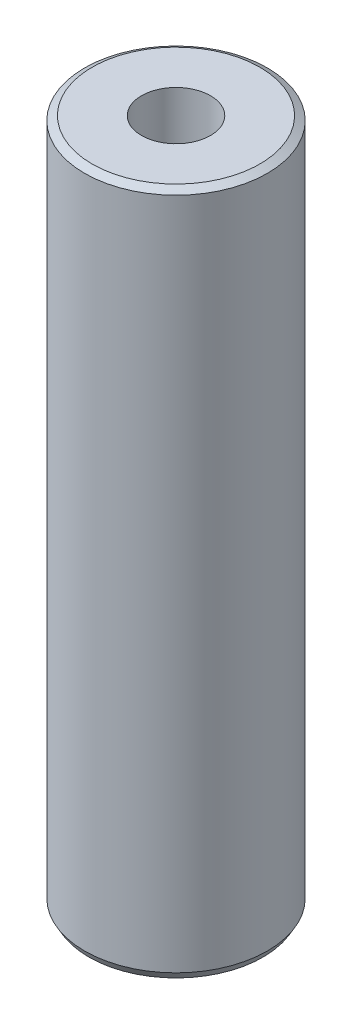
ISO-10303-21;
HEADER;
FILE_DESCRIPTION(('STEP AP214'),'2;1');
FILE_NAME('part.step','',(''),(''),'','','');
FILE_SCHEMA(('AUTOMOTIVE_DESIGN { 1 0 10303 214 1 1 1 1 }'));
ENDSEC;
DATA;
#1=APPLICATION_CONTEXT('core data for automotive mechanical design processes');
#2=APPLICATION_PROTOCOL_DEFINITION('international standard','automotive_design',2000,#1);
#3=PRODUCT_CONTEXT('',#1,'mechanical');
#4=PRODUCT('Part','Part','',(#3));
#5=PRODUCT_RELATED_PRODUCT_CATEGORY('part','',(#4));
#6=PRODUCT_DEFINITION_FORMATION('','',#4);
#7=PRODUCT_DEFINITION_CONTEXT('part definition',#1,'design');
#8=PRODUCT_DEFINITION('design','',#6,#7);
#9=PRODUCT_DEFINITION_SHAPE('','',#8);
#10=(LENGTH_UNIT() NAMED_UNIT(*) SI_UNIT(.MILLI.,.METRE.));
#11=(NAMED_UNIT(*) PLANE_ANGLE_UNIT() SI_UNIT($,.RADIAN.));
#12=(NAMED_UNIT(*) SI_UNIT($,.STERADIAN.) SOLID_ANGLE_UNIT());
#13=UNCERTAINTY_MEASURE_WITH_UNIT(LENGTH_MEASURE(1.E-05),#10,'distance_accuracy_value','');
#14=(GEOMETRIC_REPRESENTATION_CONTEXT(3) GLOBAL_UNCERTAINTY_ASSIGNED_CONTEXT((#13)) GLOBAL_UNIT_ASSIGNED_CONTEXT((#10,
#11,#12)) REPRESENTATION_CONTEXT('',''));
#15=CARTESIAN_POINT('',(0.,0.,0.));
#16=DIRECTION('',(0.,0.,1.));
#17=DIRECTION('',(1.,0.,0.));
#18=AXIS2_PLACEMENT_3D('',#15,#16,#17);
#19=CARTESIAN_POINT('',(0.,449.970885556218,0.));
#20=DIRECTION('',(0.,-1.,0.));
#21=DIRECTION('',(0.,0.,-1.));
#22=AXIS2_PLACEMENT_3D('',#19,#20,#21);
#23=CYLINDRICAL_SURFACE('',#22,60.);
#24=CARTESIAN_POINT('',(0.,447.126029534184,0.));
#25=DIRECTION('',(0.,1.,0.));
#26=DIRECTION('',(0.,0.,1.));
#27=AXIS2_PLACEMENT_3D('',#24,#25,#26);
#28=CIRCLE('',#27,60.);
#29=CARTESIAN_POINT('',(0.,447.126029534184,-60.));
#30=VERTEX_POINT('',#29);
#31=EDGE_CURVE('E50',#30,#30,#28,.F.);
#32=ORIENTED_EDGE('',*,*,#31,.T.);
#33=EDGE_LOOP('',(#32));
#34=FACE_BOUND('',#33,.T.);
#35=CARTESIAN_POINT('',(0.,4.92743517038169,0.));
#36=DIRECTION('',(0.,1.,0.));
#37=DIRECTION('',(0.,0.,1.));
#38=AXIS2_PLACEMENT_3D('',#35,#36,#37);
#39=CIRCLE('',#38,60.);
#40=CARTESIAN_POINT('',(0.,4.92743517038169,60.));
#41=VERTEX_POINT('',#40);
#42=EDGE_CURVE('E51',#41,#41,#39,.T.);
#43=ORIENTED_EDGE('',*,*,#42,.T.);
#44=EDGE_LOOP('',(#43));
#45=FACE_BOUND('',#44,.T.);
#46=ADVANCED_FACE('F39',(#34,#45),#23,.T.);
#47=CARTESIAN_POINT('',(0.,449.970885556218,0.));
#48=DIRECTION('',(0.,1.,0.));
#49=DIRECTION('',(0.,0.,1.));
#50=AXIS2_PLACEMENT_3D('',#47,#48,#49);
#51=PLANE('',#50);
#52=CARTESIAN_POINT('',(0.,449.970885556218,0.));
#53=DIRECTION('',(0.,1.,0.));
#54=DIRECTION('',(0.,0.,1.));
#55=AXIS2_PLACEMENT_3D('',#52,#53,#54);
#56=CIRCLE('',#55,55.0725648296183);
#57=CARTESIAN_POINT('',(0.,449.970885556218,-55.0725648296184));
#58=VERTEX_POINT('',#57);
#59=EDGE_CURVE('E54',#58,#58,#56,.T.);
#60=ORIENTED_EDGE('',*,*,#59,.T.);
#61=EDGE_LOOP('',(#60));
#62=FACE_BOUND('',#61,.T.);
#63=CARTESIAN_POINT('',(0.,449.970885556218,0.));
#64=DIRECTION('',(0.,1.,0.));
#65=DIRECTION('',(0.,0.,1.));
#66=AXIS2_PLACEMENT_3D('',#63,#64,#65);
#67=CIRCLE('',#66,22.6558316969732);
#68=CARTESIAN_POINT('',(0.,449.970885556218,22.6558316969732));
#69=VERTEX_POINT('',#68);
#70=EDGE_CURVE('E58',#69,#69,#67,.T.);
#71=ORIENTED_EDGE('',*,*,#70,.F.);
#72=EDGE_LOOP('',(#71));
#73=FACE_BOUND('',#72,.T.);
#74=ADVANCED_FACE('F69',(#62,#73),#51,.T.);
#75=CARTESIAN_POINT('',(0.,0.,0.));
#76=DIRECTION('',(0.,1.,0.));
#77=DIRECTION('',(0.,0.,1.));
#78=AXIS2_PLACEMENT_3D('',#75,#76,#77);
#79=PLANE('',#78);
#80=CARTESIAN_POINT('',(0.,0.,0.));
#81=DIRECTION('',(0.,1.,0.));
#82=DIRECTION('',(0.,0.,1.));
#83=AXIS2_PLACEMENT_3D('',#80,#81,#82);
#84=CIRCLE('',#83,57.1551439779657);
#85=CARTESIAN_POINT('',(0.,0.,57.1551439779657));
#86=VERTEX_POINT('',#85);
#87=EDGE_CURVE('E10',#86,#86,#84,.F.);
#88=ORIENTED_EDGE('',*,*,#87,.T.);
#89=EDGE_LOOP('',(#88));
#90=FACE_BOUND('',#89,.T.);
#91=CARTESIAN_POINT('',(0.,0.,0.));
#92=DIRECTION('',(0.,1.,0.));
#93=DIRECTION('',(0.,0.,1.));
#94=AXIS2_PLACEMENT_3D('',#91,#92,#93);
#95=CIRCLE('',#94,22.6558316969732);
#96=CARTESIAN_POINT('',(0.,0.,22.6558316969732));
#97=VERTEX_POINT('',#96);
#98=EDGE_CURVE('E63',#97,#97,#95,.T.);
#99=ORIENTED_EDGE('',*,*,#98,.T.);
#100=EDGE_LOOP('',(#99));
#101=FACE_BOUND('',#100,.T.);
#102=ADVANCED_FACE('F75',(#90,#101),#79,.F.);
#103=CARTESIAN_POINT('',(0.,449.970885556218,0.));
#104=DIRECTION('',(0.,-1.,0.));
#105=DIRECTION('',(0.,0.,-1.));
#106=AXIS2_PLACEMENT_3D('',#103,#104,#105);
#107=CYLINDRICAL_SURFACE('',#106,22.6558316969732);
#108=ORIENTED_EDGE('',*,*,#70,.T.);
#109=EDGE_LOOP('',(#108));
#110=FACE_BOUND('',#109,.T.);
#111=ORIENTED_EDGE('',*,*,#98,.F.);
#112=EDGE_LOOP('',(#111));
#113=FACE_BOUND('',#112,.T.);
#114=ADVANCED_FACE('F70',(#110,#113),#107,.F.);
#115=CARTESIAN_POINT('',(0.,449.970885556218,0.));
#116=DIRECTION('',(0.,-1.,0.));
#117=DIRECTION('',(0.,0.,-1.));
#118=AXIS2_PLACEMENT_3D('',#115,#116,#117);
#119=CONICAL_SURFACE('',#118,55.0725648296183,1.04719755119659);
#120=CARTESIAN_POINT('',(0.,447.126029534184,-60.));
#121=CARTESIAN_POINT('',(0.,447.15566345108,-59.9486725503086));
#122=CARTESIAN_POINT('',(0.,447.185297367976,-59.8973451006171));
#123=CARTESIAN_POINT('',(0.,447.244565201768,-59.7946902012341));
#124=CARTESIAN_POINT('',(0.,447.274199118665,-59.7433627515427));
#125=CARTESIAN_POINT('',(0.,447.333466952457,-59.6407078521597));
#126=CARTESIAN_POINT('',(0.,447.363100869353,-59.5893804024682));
#127=CARTESIAN_POINT('',(0.,447.422368703146,-59.4867255030853));
#128=CARTESIAN_POINT('',(0.,447.452002620042,-59.4353980533938));
#129=CARTESIAN_POINT('',(0.,447.511270453834,-59.3327431540109));
#130=CARTESIAN_POINT('',(0.,447.54090437073,-59.2814157043194));
#131=CARTESIAN_POINT('',(0.,447.600172204523,-59.1787608049364));
#132=CARTESIAN_POINT('',(0.,447.629806121419,-59.127433355245));
#133=CARTESIAN_POINT('',(0.,447.689073955211,-59.024778455862));
#134=CARTESIAN_POINT('',(0.,447.718707872107,-58.9734510061705));
#135=CARTESIAN_POINT('',(0.,447.7779757059,-58.8707961067876));
#136=CARTESIAN_POINT('',(0.,447.807609622796,-58.8194686570961));
#137=CARTESIAN_POINT('',(0.,447.866877456588,-58.7168137577131));
#138=CARTESIAN_POINT('',(0.,447.896511373485,-58.6654863080217));
#139=CARTESIAN_POINT('',(0.,447.955779207277,-58.5628314086387));
#140=CARTESIAN_POINT('',(0.,447.985413124173,-58.5115039589472));
#141=CARTESIAN_POINT('',(0.,448.044680957966,-58.4088490595643));
#142=CARTESIAN_POINT('',(0.,448.074314874862,-58.3575216098728));
#143=CARTESIAN_POINT('',(0.,448.133582708654,-58.2548667104899));
#144=CARTESIAN_POINT('',(0.,448.16321662555,-58.2035392607984));
#145=CARTESIAN_POINT('',(0.,448.222484459343,-58.1008843614154));
#146=CARTESIAN_POINT('',(0.,448.252118376239,-58.049556911724));
#147=CARTESIAN_POINT('',(0.,448.311386210031,-57.946902012341));
#148=CARTESIAN_POINT('',(0.,448.341020126927,-57.8955745626495));
#149=CARTESIAN_POINT('',(0.,448.40028796072,-57.7929196632666));
#150=CARTESIAN_POINT('',(0.,448.429921877616,-57.7415922135751));
#151=CARTESIAN_POINT('',(0.,448.489189711408,-57.6389373141922));
#152=CARTESIAN_POINT('',(0.,448.518823628305,-57.5876098645007));
#153=CARTESIAN_POINT('',(0.,448.578091462097,-57.4849549651177));
#154=CARTESIAN_POINT('',(0.,448.607725378993,-57.4336275154263));
#155=CARTESIAN_POINT('',(0.,448.666993212786,-57.3309726160433));
#156=CARTESIAN_POINT('',(0.,448.696627129682,-57.2796451663518));
#157=CARTESIAN_POINT('',(0.,448.755894963474,-57.1769902669689));
#158=CARTESIAN_POINT('',(0.,448.78552888037,-57.1256628172774));
#159=CARTESIAN_POINT('',(0.,448.844796714163,-57.0230079178944));
#160=CARTESIAN_POINT('',(0.,448.874430631059,-56.971680468203));
#161=CARTESIAN_POINT('',(0.,448.933698464851,-56.86902556882));
#162=CARTESIAN_POINT('',(0.,448.963332381747,-56.8176981191285));
#163=CARTESIAN_POINT('',(0.,449.02260021554,-56.7150432197456));
#164=CARTESIAN_POINT('',(0.,449.052234132436,-56.6637157700541));
#165=CARTESIAN_POINT('',(0.,449.111501966228,-56.5610608706712));
#166=CARTESIAN_POINT('',(0.,449.141135883125,-56.5097334209797));
#167=CARTESIAN_POINT('',(0.,449.200403716917,-56.4070785215967));
#168=CARTESIAN_POINT('',(0.,449.230037633813,-56.3557510719053));
#169=CARTESIAN_POINT('',(0.,449.289305467606,-56.2530961725223));
#170=CARTESIAN_POINT('',(0.,449.318939384502,-56.2017687228308));
#171=CARTESIAN_POINT('',(0.,449.378207218294,-56.0991138234479));
#172=CARTESIAN_POINT('',(0.,449.40784113519,-56.0477863737564));
#173=CARTESIAN_POINT('',(0.,449.467108968983,-55.9451314743735));
#174=CARTESIAN_POINT('',(0.,449.496742885879,-55.893804024682));
#175=CARTESIAN_POINT('',(0.,449.556010719671,-55.791149125299));
#176=CARTESIAN_POINT('',(0.,449.585644636567,-55.7398216756075));
#177=CARTESIAN_POINT('',(0.,449.64491247036,-55.6371667762246));
#178=CARTESIAN_POINT('',(0.,449.674546387256,-55.5858393265331));
#179=CARTESIAN_POINT('',(0.,449.733814221048,-55.4831844271502));
#180=CARTESIAN_POINT('',(0.,449.763448137945,-55.4318569774587));
#181=CARTESIAN_POINT('',(0.,449.822715971737,-55.3292020780757));
#182=CARTESIAN_POINT('',(0.,449.852349888633,-55.2778746283843));
#183=CARTESIAN_POINT('',(0.,449.911617722426,-55.1752197290013));
#184=CARTESIAN_POINT('',(0.,449.941251639322,-55.1238922793098));
#185=CARTESIAN_POINT('',(0.,449.970885556218,-55.0725648296184));
#186=B_SPLINE_CURVE_WITH_KNOTS('',3,(#120,#121,#122,#123,#124,#125,#126,#127,#128,#129,#130,
#131,#132,#133,#134,#135,#136,#137,#138,#139,#140,#141,#142,#143,#144,#145,#146,#147,#148,#149,
#150,#151,#152,#153,#154,#155,#156,#157,#158,#159,#160,#161,#162,#163,#164,#165,#166,#167,#168,
#169,#170,#171,#172,#173,#174,#175,#176,#177,#178,#179,#180,#181,#182,#183,#184,#185),
.UNSPECIFIED.,.F.,.F.,(4,2,2,2,2,2,2,2,2,2,2,2,2,2,2,2,2,2,2,2,2,2,2,2,2,2,2,2,2,2,2,2,4),(0.,
0.177803501377155,0.355607002754309,0.533410504131442,0.711214005508597,0.889017506885724,
1.06682100826288,1.24462450964001,1.42242801101717,1.60023151239432,1.77803501377145,
1.9558385151486,2.13364201652574,2.31144551790289,2.48924901928002,2.66705252065717,
2.8448560220343,3.02265952341146,3.20046302478861,3.37826652616574,3.5560700275429,
3.73387352892003,3.91167703029718,4.08948053167431,4.26728403305146,4.44508753442863,
4.62289103580575,4.80069453718291,4.97849803856004,5.15630153993719,5.33410504131432,
5.51190854269148,5.68971204406863),.UNSPECIFIED.);
#187=EDGE_CURVE('BSEAM81',#30,#58,#186,.T.);
#188=ORIENTED_EDGE('',*,*,#31,.F.);
#189=ORIENTED_EDGE('',*,*,#59,.F.);
#190=ORIENTED_EDGE('',*,*,#187,.T.);
#191=ORIENTED_EDGE('',*,*,#187,.F.);
#192=EDGE_LOOP('',(#188,#190,#189,#191));
#193=FACE_BOUND('',#192,.T.);
#194=ADVANCED_FACE('F81',(#193),#119,.T.);
#195=CARTESIAN_POINT('',(0.,4.92743517038169,0.));
#196=DIRECTION('',(0.,1.,0.));
#197=DIRECTION('',(0.,0.,1.));
#198=AXIS2_PLACEMENT_3D('',#195,#196,#197);
#199=CONICAL_SURFACE('',#198,60.,0.523598775598303);
#200=ORIENTED_EDGE('',*,*,#87,.F.);
#201=EDGE_LOOP('',(#200));
#202=FACE_BOUND('',#201,.T.);
#203=ORIENTED_EDGE('',*,*,#42,.F.);
#204=EDGE_LOOP('',(#203));
#205=FACE_BOUND('',#204,.T.);
#206=ADVANCED_FACE('F45',(#202,#205),#199,.T.);
#207=CLOSED_SHELL('',(#46,#74,#102,#114,#194,#206));
#208=MANIFOLD_SOLID_BREP('B2',#207);
#209=ADVANCED_BREP_SHAPE_REPRESENTATION('',(#18,#208),#14);
#210=SHAPE_DEFINITION_REPRESENTATION(#9,#209);
ENDSEC;
END-ISO-10303-21;
